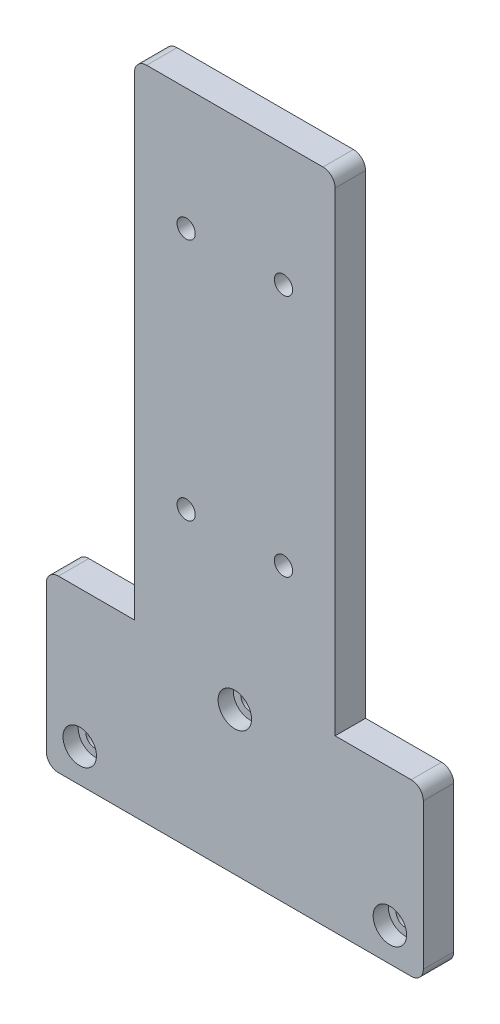
ISO-10303-21;
HEADER;
FILE_DESCRIPTION(('STEP AP214'),'2;1');
FILE_NAME('part.step','',(''),(''),'','','');
FILE_SCHEMA(('AUTOMOTIVE_DESIGN { 1 0 10303 214 1 1 1 1 }'));
ENDSEC;
DATA;
#1=APPLICATION_CONTEXT('core data for automotive mechanical design processes');
#2=APPLICATION_PROTOCOL_DEFINITION('international standard','automotive_design',2000,#1);
#3=PRODUCT_CONTEXT('',#1,'mechanical');
#4=PRODUCT('Part','Part','',(#3));
#5=PRODUCT_RELATED_PRODUCT_CATEGORY('part','',(#4));
#6=PRODUCT_DEFINITION_FORMATION('','',#4);
#7=PRODUCT_DEFINITION_CONTEXT('part definition',#1,'design');
#8=PRODUCT_DEFINITION('design','',#6,#7);
#9=PRODUCT_DEFINITION_SHAPE('','',#8);
#10=(LENGTH_UNIT() NAMED_UNIT(*) SI_UNIT(.MILLI.,.METRE.));
#11=(NAMED_UNIT(*) PLANE_ANGLE_UNIT() SI_UNIT($,.RADIAN.));
#12=(NAMED_UNIT(*) SI_UNIT($,.STERADIAN.) SOLID_ANGLE_UNIT());
#13=UNCERTAINTY_MEASURE_WITH_UNIT(LENGTH_MEASURE(1.E-05),#10,'distance_accuracy_value','');
#14=(GEOMETRIC_REPRESENTATION_CONTEXT(3) GLOBAL_UNCERTAINTY_ASSIGNED_CONTEXT((#13)) GLOBAL_UNIT_ASSIGNED_CONTEXT((#10,
#11,#12)) REPRESENTATION_CONTEXT('',''));
#15=CARTESIAN_POINT('',(0.,0.,0.));
#16=DIRECTION('',(0.,0.,1.));
#17=DIRECTION('',(1.,0.,0.));
#18=AXIS2_PLACEMENT_3D('',#15,#16,#17);
#19=CARTESIAN_POINT('',(31.,0.,5.));
#20=DIRECTION('',(0.,1.,0.));
#21=DIRECTION('',(-1.,0.,0.));
#22=AXIS2_PLACEMENT_3D('',#19,#20,#21);
#23=PLANE('',#22);
#24=DIRECTION('',(1.,0.,0.));
#25=VECTOR('',#24,1.);
#26=CARTESIAN_POINT('',(31.,0.,0.));
#27=LINE('',#26,#25);
#28=CARTESIAN_POINT('',(-29.,0.,0.));
#29=VERTEX_POINT('',#28);
#30=CARTESIAN_POINT('',(29.,0.,0.));
#31=VERTEX_POINT('',#30);
#32=EDGE_CURVE('E176',#29,#31,#27,.T.);
#33=ORIENTED_EDGE('',*,*,#32,.T.);
#34=DIRECTION('',(0.,0.,-1.));
#35=VECTOR('',#34,1.);
#36=CARTESIAN_POINT('',(29.,0.,5.));
#37=LINE('',#36,#35);
#38=CARTESIAN_POINT('',(29.,0.,5.));
#39=VERTEX_POINT('',#38);
#40=EDGE_CURVE('E239',#31,#39,#37,.F.);
#41=ORIENTED_EDGE('',*,*,#40,.T.);
#42=DIRECTION('',(1.,0.,0.));
#43=VECTOR('',#42,1.);
#44=CARTESIAN_POINT('',(31.,0.,5.));
#45=LINE('',#44,#43);
#46=CARTESIAN_POINT('',(-29.,0.,5.));
#47=VERTEX_POINT('',#46);
#48=EDGE_CURVE('E196',#47,#39,#45,.T.);
#49=ORIENTED_EDGE('',*,*,#48,.F.);
#50=DIRECTION('',(0.,0.,-1.));
#51=VECTOR('',#50,1.);
#52=CARTESIAN_POINT('',(-29.,0.,5.));
#53=LINE('',#52,#51);
#54=EDGE_CURVE('E236',#47,#29,#53,.T.);
#55=ORIENTED_EDGE('',*,*,#54,.T.);
#56=EDGE_LOOP('',(#33,#41,#49,#55));
#57=FACE_BOUND('',#56,.T.);
#58=ADVANCED_FACE('F36',(#57),#23,.F.);
#59=CARTESIAN_POINT('',(31.,28.,5.));
#60=DIRECTION('',(-1.,0.,0.));
#61=DIRECTION('',(0.,-1.,0.));
#62=AXIS2_PLACEMENT_3D('',#59,#60,#61);
#63=PLANE('',#62);
#64=DIRECTION('',(0.,1.,0.));
#65=VECTOR('',#64,1.);
#66=CARTESIAN_POINT('',(31.,28.,0.));
#67=LINE('',#66,#65);
#68=CARTESIAN_POINT('',(31.,2.00000000000001,0.));
#69=VERTEX_POINT('',#68);
#70=CARTESIAN_POINT('',(31.,26.,0.));
#71=VERTEX_POINT('',#70);
#72=EDGE_CURVE('E179',#69,#71,#67,.T.);
#73=ORIENTED_EDGE('',*,*,#72,.T.);
#74=DIRECTION('',(0.,0.,-1.));
#75=VECTOR('',#74,1.);
#76=CARTESIAN_POINT('',(31.,26.,5.));
#77=LINE('',#76,#75);
#78=CARTESIAN_POINT('',(31.,26.,5.));
#79=VERTEX_POINT('',#78);
#80=EDGE_CURVE('E234',#71,#79,#77,.F.);
#81=ORIENTED_EDGE('',*,*,#80,.T.);
#82=DIRECTION('',(0.,1.,0.));
#83=VECTOR('',#82,1.);
#84=CARTESIAN_POINT('',(31.,28.,5.));
#85=LINE('',#84,#83);
#86=CARTESIAN_POINT('',(31.,2.00000000000001,5.));
#87=VERTEX_POINT('',#86);
#88=EDGE_CURVE('E149',#87,#79,#85,.T.);
#89=ORIENTED_EDGE('',*,*,#88,.F.);
#90=DIRECTION('',(0.,0.,-1.));
#91=VECTOR('',#90,1.);
#92=CARTESIAN_POINT('',(31.,2.00000000000001,5.));
#93=LINE('',#92,#91);
#94=EDGE_CURVE('E231',#87,#69,#93,.T.);
#95=ORIENTED_EDGE('',*,*,#94,.T.);
#96=EDGE_LOOP('',(#73,#81,#89,#95));
#97=FACE_BOUND('',#96,.T.);
#98=ADVANCED_FACE('F393',(#97),#63,.F.);
#99=CARTESIAN_POINT('',(16.5,28.,5.));
#100=DIRECTION('',(0.,-1.,0.));
#101=DIRECTION('',(1.,0.,0.));
#102=AXIS2_PLACEMENT_3D('',#99,#100,#101);
#103=PLANE('',#102);
#104=DIRECTION('',(-1.,0.,0.));
#105=VECTOR('',#104,1.);
#106=CARTESIAN_POINT('',(16.5,28.,5.));
#107=LINE('',#106,#105);
#108=CARTESIAN_POINT('',(29.,28.,5.));
#109=VERTEX_POINT('',#108);
#110=CARTESIAN_POINT('',(16.5,28.,5.));
#111=VERTEX_POINT('',#110);
#112=EDGE_CURVE('E136',#109,#111,#107,.T.);
#113=ORIENTED_EDGE('',*,*,#112,.F.);
#114=DIRECTION('',(0.,0.,-1.));
#115=VECTOR('',#114,1.);
#116=CARTESIAN_POINT('',(29.,28.,5.));
#117=LINE('',#116,#115);
#118=CARTESIAN_POINT('',(29.,28.,0.));
#119=VERTEX_POINT('',#118);
#120=EDGE_CURVE('E229',#109,#119,#117,.T.);
#121=ORIENTED_EDGE('',*,*,#120,.T.);
#122=DIRECTION('',(-1.,0.,0.));
#123=VECTOR('',#122,1.);
#124=CARTESIAN_POINT('',(16.5,28.,0.));
#125=LINE('',#124,#123);
#126=CARTESIAN_POINT('',(16.5,28.,0.));
#127=VERTEX_POINT('',#126);
#128=EDGE_CURVE('E155',#119,#127,#125,.T.);
#129=ORIENTED_EDGE('',*,*,#128,.T.);
#130=DIRECTION('',(0.,0.,-1.));
#131=VECTOR('',#130,1.);
#132=CARTESIAN_POINT('',(16.5,28.,5.));
#133=LINE('',#132,#131);
#134=EDGE_CURVE('E152',#111,#127,#133,.T.);
#135=ORIENTED_EDGE('',*,*,#134,.F.);
#136=EDGE_LOOP('',(#113,#121,#129,#135));
#137=FACE_BOUND('',#136,.T.);
#138=ADVANCED_FACE('F153',(#137),#103,.F.);
#139=CARTESIAN_POINT('',(16.5,108.,5.));
#140=DIRECTION('',(-1.,0.,0.));
#141=DIRECTION('',(0.,-1.,0.));
#142=AXIS2_PLACEMENT_3D('',#139,#140,#141);
#143=PLANE('',#142);
#144=DIRECTION('',(0.,1.,0.));
#145=VECTOR('',#144,1.);
#146=CARTESIAN_POINT('',(16.5,108.,0.));
#147=LINE('',#146,#145);
#148=CARTESIAN_POINT('',(16.5,106.,0.));
#149=VERTEX_POINT('',#148);
#150=EDGE_CURVE('E184',#127,#149,#147,.T.);
#151=ORIENTED_EDGE('',*,*,#150,.T.);
#152=DIRECTION('',(0.,0.,-1.));
#153=VECTOR('',#152,1.);
#154=CARTESIAN_POINT('',(16.5,106.,5.));
#155=LINE('',#154,#153);
#156=CARTESIAN_POINT('',(16.5,106.,5.));
#157=VERTEX_POINT('',#156);
#158=EDGE_CURVE('E164',#149,#157,#155,.F.);
#159=ORIENTED_EDGE('',*,*,#158,.T.);
#160=DIRECTION('',(0.,1.,0.));
#161=VECTOR('',#160,1.);
#162=CARTESIAN_POINT('',(16.5,108.,5.));
#163=LINE('',#162,#161);
#164=EDGE_CURVE('E141',#111,#157,#163,.T.);
#165=ORIENTED_EDGE('',*,*,#164,.F.);
#166=ORIENTED_EDGE('',*,*,#134,.T.);
#167=EDGE_LOOP('',(#151,#159,#165,#166));
#168=FACE_BOUND('',#167,.T.);
#169=ADVANCED_FACE('F162',(#168),#143,.F.);
#170=CARTESIAN_POINT('',(-16.5,108.,5.));
#171=DIRECTION('',(0.,-1.,0.));
#172=DIRECTION('',(0.,0.,-1.));
#173=AXIS2_PLACEMENT_3D('',#170,#171,#172);
#174=PLANE('',#173);
#175=DIRECTION('',(-1.,0.,0.));
#176=VECTOR('',#175,1.);
#177=CARTESIAN_POINT('',(-16.5,108.,0.));
#178=LINE('',#177,#176);
#179=CARTESIAN_POINT('',(14.5,108.,0.));
#180=VERTEX_POINT('',#179);
#181=CARTESIAN_POINT('',(-14.5,108.,0.));
#182=VERTEX_POINT('',#181);
#183=EDGE_CURVE('E186',#180,#182,#178,.T.);
#184=ORIENTED_EDGE('',*,*,#183,.T.);
#185=DIRECTION('',(0.,0.,-1.));
#186=VECTOR('',#185,1.);
#187=CARTESIAN_POINT('',(-14.5,108.,5.));
#188=LINE('',#187,#186);
#189=CARTESIAN_POINT('',(-14.5,108.,5.));
#190=VERTEX_POINT('',#189);
#191=EDGE_CURVE('E216',#182,#190,#188,.F.);
#192=ORIENTED_EDGE('',*,*,#191,.T.);
#193=DIRECTION('',(-1.,0.,0.));
#194=VECTOR('',#193,1.);
#195=CARTESIAN_POINT('',(-16.5,108.,5.));
#196=LINE('',#195,#194);
#197=CARTESIAN_POINT('',(14.5,108.,5.));
#198=VERTEX_POINT('',#197);
#199=EDGE_CURVE('E165',#198,#190,#196,.T.);
#200=ORIENTED_EDGE('',*,*,#199,.F.);
#201=DIRECTION('',(0.,0.,-1.));
#202=VECTOR('',#201,1.);
#203=CARTESIAN_POINT('',(14.5,108.,5.));
#204=LINE('',#203,#202);
#205=EDGE_CURVE('E213',#198,#180,#204,.T.);
#206=ORIENTED_EDGE('',*,*,#205,.T.);
#207=EDGE_LOOP('',(#184,#192,#200,#206));
#208=FACE_BOUND('',#207,.T.);
#209=ADVANCED_FACE('F435',(#208),#174,.F.);
#210=CARTESIAN_POINT('',(-16.5,28.,5.));
#211=DIRECTION('',(1.,0.,0.));
#212=DIRECTION('',(0.,0.,-1.));
#213=AXIS2_PLACEMENT_3D('',#210,#211,#212);
#214=PLANE('',#213);
#215=DIRECTION('',(0.,-1.,0.));
#216=VECTOR('',#215,1.);
#217=CARTESIAN_POINT('',(-16.5,28.,5.));
#218=LINE('',#217,#216);
#219=CARTESIAN_POINT('',(-16.5,106.,5.));
#220=VERTEX_POINT('',#219);
#221=CARTESIAN_POINT('',(-16.5,28.,5.));
#222=VERTEX_POINT('',#221);
#223=EDGE_CURVE('E167',#220,#222,#218,.T.);
#224=ORIENTED_EDGE('',*,*,#223,.F.);
#225=DIRECTION('',(0.,0.,-1.));
#226=VECTOR('',#225,1.);
#227=CARTESIAN_POINT('',(-16.5,106.,5.));
#228=LINE('',#227,#226);
#229=CARTESIAN_POINT('',(-16.5,106.,0.));
#230=VERTEX_POINT('',#229);
#231=EDGE_CURVE('E159',#220,#230,#228,.T.);
#232=ORIENTED_EDGE('',*,*,#231,.T.);
#233=DIRECTION('',(0.,-1.,0.));
#234=VECTOR('',#233,1.);
#235=CARTESIAN_POINT('',(-16.5,28.,0.));
#236=LINE('',#235,#234);
#237=CARTESIAN_POINT('',(-16.5,28.,0.));
#238=VERTEX_POINT('',#237);
#239=EDGE_CURVE('E189',#230,#238,#236,.T.);
#240=ORIENTED_EDGE('',*,*,#239,.T.);
#241=DIRECTION('',(0.,0.,-1.));
#242=VECTOR('',#241,1.);
#243=CARTESIAN_POINT('',(-16.5,28.,5.));
#244=LINE('',#243,#242);
#245=EDGE_CURVE('E160',#222,#238,#244,.T.);
#246=ORIENTED_EDGE('',*,*,#245,.F.);
#247=EDGE_LOOP('',(#224,#232,#240,#246));
#248=FACE_BOUND('',#247,.T.);
#249=ADVANCED_FACE('F431',(#248),#214,.F.);
#250=CARTESIAN_POINT('',(-31.,28.,5.));
#251=DIRECTION('',(0.,-1.,0.));
#252=DIRECTION('',(1.,0.,0.));
#253=AXIS2_PLACEMENT_3D('',#250,#251,#252);
#254=PLANE('',#253);
#255=DIRECTION('',(-1.,0.,0.));
#256=VECTOR('',#255,1.);
#257=CARTESIAN_POINT('',(-31.,28.,0.));
#258=LINE('',#257,#256);
#259=CARTESIAN_POINT('',(-29.,28.,0.));
#260=VERTEX_POINT('',#259);
#261=EDGE_CURVE('E191',#238,#260,#258,.T.);
#262=ORIENTED_EDGE('',*,*,#261,.T.);
#263=DIRECTION('',(0.,0.,-1.));
#264=VECTOR('',#263,1.);
#265=CARTESIAN_POINT('',(-29.,28.,5.));
#266=LINE('',#265,#264);
#267=CARTESIAN_POINT('',(-29.,28.,5.));
#268=VERTEX_POINT('',#267);
#269=EDGE_CURVE('E11',#260,#268,#266,.F.);
#270=ORIENTED_EDGE('',*,*,#269,.T.);
#271=DIRECTION('',(-1.,0.,0.));
#272=VECTOR('',#271,1.);
#273=CARTESIAN_POINT('',(-31.,28.,5.));
#274=LINE('',#273,#272);
#275=EDGE_CURVE('E172',#222,#268,#274,.T.);
#276=ORIENTED_EDGE('',*,*,#275,.F.);
#277=ORIENTED_EDGE('',*,*,#245,.T.);
#278=EDGE_LOOP('',(#262,#270,#276,#277));
#279=FACE_BOUND('',#278,.T.);
#280=ADVANCED_FACE('F389',(#279),#254,.F.);
#281=CARTESIAN_POINT('',(-31.,0.,5.));
#282=DIRECTION('',(1.,0.,0.));
#283=DIRECTION('',(0.,0.,-1.));
#284=AXIS2_PLACEMENT_3D('',#281,#282,#283);
#285=PLANE('',#284);
#286=DIRECTION('',(0.,-1.,0.));
#287=VECTOR('',#286,1.);
#288=CARTESIAN_POINT('',(-31.,0.,0.));
#289=LINE('',#288,#287);
#290=CARTESIAN_POINT('',(-31.,26.,0.));
#291=VERTEX_POINT('',#290);
#292=CARTESIAN_POINT('',(-31.,2.,0.));
#293=VERTEX_POINT('',#292);
#294=EDGE_CURVE('E194',#291,#293,#289,.T.);
#295=ORIENTED_EDGE('',*,*,#294,.T.);
#296=DIRECTION('',(0.,0.,-1.));
#297=VECTOR('',#296,1.);
#298=CARTESIAN_POINT('',(-31.,2.,5.));
#299=LINE('',#298,#297);
#300=CARTESIAN_POINT('',(-31.,2.,5.));
#301=VERTEX_POINT('',#300);
#302=EDGE_CURVE('E44',#293,#301,#299,.F.);
#303=ORIENTED_EDGE('',*,*,#302,.T.);
#304=DIRECTION('',(0.,-1.,0.));
#305=VECTOR('',#304,1.);
#306=CARTESIAN_POINT('',(-31.,0.,5.));
#307=LINE('',#306,#305);
#308=CARTESIAN_POINT('',(-31.,26.,5.));
#309=VERTEX_POINT('',#308);
#310=EDGE_CURVE('E174',#309,#301,#307,.T.);
#311=ORIENTED_EDGE('',*,*,#310,.F.);
#312=DIRECTION('',(0.,0.,-1.));
#313=VECTOR('',#312,1.);
#314=CARTESIAN_POINT('',(-31.,26.,5.));
#315=LINE('',#314,#313);
#316=EDGE_CURVE('E241',#309,#291,#315,.T.);
#317=ORIENTED_EDGE('',*,*,#316,.T.);
#318=EDGE_LOOP('',(#295,#303,#311,#317));
#319=FACE_BOUND('',#318,.T.);
#320=ADVANCED_FACE('F245',(#319),#285,.F.);
#321=CARTESIAN_POINT('',(0.,0.,5.));
#322=DIRECTION('',(0.,0.,-1.));
#323=DIRECTION('',(-1.,0.,0.));
#324=AXIS2_PLACEMENT_3D('',#321,#322,#323);
#325=PLANE('',#324);
#326=CARTESIAN_POINT('',(7.99999999999999,48.,5.));
#327=DIRECTION('',(0.,0.,-1.));
#328=DIRECTION('',(-1.,0.,0.));
#329=AXIS2_PLACEMENT_3D('',#326,#327,#328);
#330=CIRCLE('',#329,1.50000000000001);
#331=CARTESIAN_POINT('',(6.49999999999998,48.,5.));
#332=VERTEX_POINT('',#331);
#333=EDGE_CURVE('E334',#332,#332,#330,.T.);
#334=ORIENTED_EDGE('',*,*,#333,.T.);
#335=EDGE_LOOP('',(#334));
#336=FACE_BOUND('',#335,.T.);
#337=CARTESIAN_POINT('',(-8.,48.,5.));
#338=DIRECTION('',(0.,0.,-1.));
#339=DIRECTION('',(-1.,0.,0.));
#340=AXIS2_PLACEMENT_3D('',#337,#338,#339);
#341=CIRCLE('',#340,1.50000000000001);
#342=CARTESIAN_POINT('',(-9.50000000000001,48.,5.));
#343=VERTEX_POINT('',#342);
#344=EDGE_CURVE('E322',#343,#343,#341,.T.);
#345=ORIENTED_EDGE('',*,*,#344,.T.);
#346=EDGE_LOOP('',(#345));
#347=FACE_BOUND('',#346,.T.);
#348=CARTESIAN_POINT('',(-8.,88.,5.));
#349=DIRECTION('',(0.,0.,-1.));
#350=DIRECTION('',(-1.,0.,0.));
#351=AXIS2_PLACEMENT_3D('',#348,#349,#350);
#352=CIRCLE('',#351,1.50000000000001);
#353=CARTESIAN_POINT('',(-9.50000000000001,88.,5.));
#354=VERTEX_POINT('',#353);
#355=EDGE_CURVE('E310',#354,#354,#352,.T.);
#356=ORIENTED_EDGE('',*,*,#355,.T.);
#357=EDGE_LOOP('',(#356));
#358=FACE_BOUND('',#357,.T.);
#359=CARTESIAN_POINT('',(7.99999999999999,88.,5.));
#360=DIRECTION('',(0.,0.,-1.));
#361=DIRECTION('',(-1.,0.,0.));
#362=AXIS2_PLACEMENT_3D('',#359,#360,#361);
#363=CIRCLE('',#362,1.50000000000001);
#364=CARTESIAN_POINT('',(6.49999999999998,88.,5.));
#365=VERTEX_POINT('',#364);
#366=EDGE_CURVE('E298',#365,#365,#363,.T.);
#367=ORIENTED_EDGE('',*,*,#366,.T.);
#368=EDGE_LOOP('',(#367));
#369=FACE_BOUND('',#368,.T.);
#370=CARTESIAN_POINT('',(-25.5,5.5,5.));
#371=DIRECTION('',(0.,0.,1.));
#372=DIRECTION('',(1.,0.,0.));
#373=AXIS2_PLACEMENT_3D('',#370,#371,#372);
#374=CIRCLE('',#373,2.75000000000001);
#375=CARTESIAN_POINT('',(-22.75,5.5,5.));
#376=VERTEX_POINT('',#375);
#377=EDGE_CURVE('E295',#376,#376,#374,.T.);
#378=ORIENTED_EDGE('',*,*,#377,.F.);
#379=EDGE_LOOP('',(#378));
#380=FACE_BOUND('',#379,.T.);
#381=CARTESIAN_POINT('',(25.5,5.5,5.));
#382=DIRECTION('',(0.,0.,1.));
#383=DIRECTION('',(1.,0.,0.));
#384=AXIS2_PLACEMENT_3D('',#381,#382,#383);
#385=CIRCLE('',#384,2.75000000000001);
#386=CARTESIAN_POINT('',(28.25,5.5,5.));
#387=VERTEX_POINT('',#386);
#388=EDGE_CURVE('E283',#387,#387,#385,.T.);
#389=ORIENTED_EDGE('',*,*,#388,.F.);
#390=EDGE_LOOP('',(#389));
#391=FACE_BOUND('',#390,.T.);
#392=CARTESIAN_POINT('',(0.,23.5,5.));
#393=DIRECTION('',(0.,0.,1.));
#394=DIRECTION('',(1.,0.,0.));
#395=AXIS2_PLACEMENT_3D('',#392,#393,#394);
#396=CIRCLE('',#395,2.75000000000001);
#397=CARTESIAN_POINT('',(2.75000000000001,23.5,5.));
#398=VERTEX_POINT('',#397);
#399=EDGE_CURVE('E271',#398,#398,#396,.T.);
#400=ORIENTED_EDGE('',*,*,#399,.F.);
#401=EDGE_LOOP('',(#400));
#402=FACE_BOUND('',#401,.T.);
#403=ORIENTED_EDGE('',*,*,#199,.T.);
#404=CARTESIAN_POINT('',(-14.5,106.,5.));
#405=DIRECTION('',(0.,0.,-1.));
#406=DIRECTION('',(-1.,0.,0.));
#407=AXIS2_PLACEMENT_3D('',#404,#405,#406);
#408=CIRCLE('',#407,2.);
#409=EDGE_CURVE('E226',#190,#220,#408,.F.);
#410=ORIENTED_EDGE('',*,*,#409,.T.);
#411=ORIENTED_EDGE('',*,*,#223,.T.);
#412=ORIENTED_EDGE('',*,*,#275,.T.);
#413=CARTESIAN_POINT('',(-29.,26.,5.));
#414=DIRECTION('',(0.,0.,-1.));
#415=DIRECTION('',(-1.,0.,0.));
#416=AXIS2_PLACEMENT_3D('',#413,#414,#415);
#417=CIRCLE('',#416,2.);
#418=EDGE_CURVE('E57',#268,#309,#417,.F.);
#419=ORIENTED_EDGE('',*,*,#418,.T.);
#420=ORIENTED_EDGE('',*,*,#310,.T.);
#421=CARTESIAN_POINT('',(-29.,2.,5.));
#422=DIRECTION('',(0.,0.,-1.));
#423=DIRECTION('',(-1.,0.,0.));
#424=AXIS2_PLACEMENT_3D('',#421,#422,#423);
#425=CIRCLE('',#424,2.);
#426=EDGE_CURVE('E219',#301,#47,#425,.F.);
#427=ORIENTED_EDGE('',*,*,#426,.T.);
#428=ORIENTED_EDGE('',*,*,#48,.T.);
#429=CARTESIAN_POINT('',(29.,2.00000000000001,5.));
#430=DIRECTION('',(0.,0.,-1.));
#431=DIRECTION('',(-1.,0.,0.));
#432=AXIS2_PLACEMENT_3D('',#429,#430,#431);
#433=CIRCLE('',#432,2.);
#434=EDGE_CURVE('E221',#39,#87,#433,.F.);
#435=ORIENTED_EDGE('',*,*,#434,.T.);
#436=ORIENTED_EDGE('',*,*,#88,.T.);
#437=CARTESIAN_POINT('',(29.,26.,5.));
#438=DIRECTION('',(0.,0.,-1.));
#439=DIRECTION('',(-1.,0.,0.));
#440=AXIS2_PLACEMENT_3D('',#437,#438,#439);
#441=CIRCLE('',#440,2.);
#442=EDGE_CURVE('E145',#79,#109,#441,.F.);
#443=ORIENTED_EDGE('',*,*,#442,.T.);
#444=ORIENTED_EDGE('',*,*,#112,.T.);
#445=ORIENTED_EDGE('',*,*,#164,.T.);
#446=CARTESIAN_POINT('',(14.5,106.,5.));
#447=DIRECTION('',(0.,0.,-1.));
#448=DIRECTION('',(-1.,0.,0.));
#449=AXIS2_PLACEMENT_3D('',#446,#447,#448);
#450=CIRCLE('',#449,2.);
#451=EDGE_CURVE('E224',#157,#198,#450,.F.);
#452=ORIENTED_EDGE('',*,*,#451,.T.);
#453=EDGE_LOOP('',(#403,#410,#411,#412,#419,#420,#427,#428,#435,#436,#443,#444,#445,#452));
#454=FACE_BOUND('',#453,.T.);
#455=ADVANCED_FACE('F139',(#336,#347,#358,#369,#380,#391,#402,#454),#325,.F.);
#456=CARTESIAN_POINT('',(0.,0.,0.));
#457=DIRECTION('',(0.,0.,-1.));
#458=DIRECTION('',(-1.,0.,0.));
#459=AXIS2_PLACEMENT_3D('',#456,#457,#458);
#460=PLANE('',#459);
#461=CARTESIAN_POINT('',(7.99999999999999,48.,0.));
#462=DIRECTION('',(0.,0.,-1.));
#463=DIRECTION('',(-1.,0.,0.));
#464=AXIS2_PLACEMENT_3D('',#461,#462,#463);
#465=CIRCLE('',#464,2.75000000000001);
#466=CARTESIAN_POINT('',(5.24999999999998,48.,0.));
#467=VERTEX_POINT('',#466);
#468=EDGE_CURVE('E343',#467,#467,#465,.T.);
#469=ORIENTED_EDGE('',*,*,#468,.F.);
#470=EDGE_LOOP('',(#469));
#471=FACE_BOUND('',#470,.T.);
#472=CARTESIAN_POINT('',(-8.,48.,0.));
#473=DIRECTION('',(0.,0.,-1.));
#474=DIRECTION('',(-1.,0.,0.));
#475=AXIS2_PLACEMENT_3D('',#472,#473,#474);
#476=CIRCLE('',#475,2.75000000000001);
#477=CARTESIAN_POINT('',(-10.75,48.,0.));
#478=VERTEX_POINT('',#477);
#479=EDGE_CURVE('E331',#478,#478,#476,.T.);
#480=ORIENTED_EDGE('',*,*,#479,.F.);
#481=EDGE_LOOP('',(#480));
#482=FACE_BOUND('',#481,.T.);
#483=CARTESIAN_POINT('',(-8.,88.,0.));
#484=DIRECTION('',(0.,0.,-1.));
#485=DIRECTION('',(-1.,0.,0.));
#486=AXIS2_PLACEMENT_3D('',#483,#484,#485);
#487=CIRCLE('',#486,2.75000000000001);
#488=CARTESIAN_POINT('',(-10.75,88.,0.));
#489=VERTEX_POINT('',#488);
#490=EDGE_CURVE('E319',#489,#489,#487,.T.);
#491=ORIENTED_EDGE('',*,*,#490,.F.);
#492=EDGE_LOOP('',(#491));
#493=FACE_BOUND('',#492,.T.);
#494=CARTESIAN_POINT('',(7.99999999999999,88.,0.));
#495=DIRECTION('',(0.,0.,-1.));
#496=DIRECTION('',(-1.,0.,0.));
#497=AXIS2_PLACEMENT_3D('',#494,#495,#496);
#498=CIRCLE('',#497,2.75000000000001);
#499=CARTESIAN_POINT('',(5.24999999999998,88.,0.));
#500=VERTEX_POINT('',#499);
#501=EDGE_CURVE('E307',#500,#500,#498,.T.);
#502=ORIENTED_EDGE('',*,*,#501,.F.);
#503=EDGE_LOOP('',(#502));
#504=FACE_BOUND('',#503,.T.);
#505=CARTESIAN_POINT('',(-25.5,5.5,0.));
#506=DIRECTION('',(0.,0.,1.));
#507=DIRECTION('',(1.,0.,0.));
#508=AXIS2_PLACEMENT_3D('',#505,#506,#507);
#509=CIRCLE('',#508,1.50000000000001);
#510=CARTESIAN_POINT('',(-24.,5.5,0.));
#511=VERTEX_POINT('',#510);
#512=EDGE_CURVE('E286',#511,#511,#509,.T.);
#513=ORIENTED_EDGE('',*,*,#512,.T.);
#514=EDGE_LOOP('',(#513));
#515=FACE_BOUND('',#514,.T.);
#516=CARTESIAN_POINT('',(25.5,5.5,0.));
#517=DIRECTION('',(0.,0.,1.));
#518=DIRECTION('',(1.,0.,0.));
#519=AXIS2_PLACEMENT_3D('',#516,#517,#518);
#520=CIRCLE('',#519,1.50000000000001);
#521=CARTESIAN_POINT('',(27.,5.5,0.));
#522=VERTEX_POINT('',#521);
#523=EDGE_CURVE('E274',#522,#522,#520,.T.);
#524=ORIENTED_EDGE('',*,*,#523,.T.);
#525=EDGE_LOOP('',(#524));
#526=FACE_BOUND('',#525,.T.);
#527=CARTESIAN_POINT('',(0.,23.5,0.));
#528=DIRECTION('',(0.,0.,1.));
#529=DIRECTION('',(1.,0.,0.));
#530=AXIS2_PLACEMENT_3D('',#527,#528,#529);
#531=CIRCLE('',#530,1.50000000000001);
#532=CARTESIAN_POINT('',(1.50000000000001,23.5,0.));
#533=VERTEX_POINT('',#532);
#534=EDGE_CURVE('E180',#533,#533,#531,.T.);
#535=ORIENTED_EDGE('',*,*,#534,.T.);
#536=EDGE_LOOP('',(#535));
#537=FACE_BOUND('',#536,.T.);
#538=ORIENTED_EDGE('',*,*,#239,.F.);
#539=CARTESIAN_POINT('',(-14.5,106.,0.));
#540=DIRECTION('',(0.,0.,-1.));
#541=DIRECTION('',(-1.,0.,0.));
#542=AXIS2_PLACEMENT_3D('',#539,#540,#541);
#543=CIRCLE('',#542,2.);
#544=EDGE_CURVE('E211',#230,#182,#543,.T.);
#545=ORIENTED_EDGE('',*,*,#544,.T.);
#546=ORIENTED_EDGE('',*,*,#183,.F.);
#547=CARTESIAN_POINT('',(14.5,106.,0.));
#548=DIRECTION('',(0.,0.,-1.));
#549=DIRECTION('',(-1.,0.,0.));
#550=AXIS2_PLACEMENT_3D('',#547,#548,#549);
#551=CIRCLE('',#550,2.);
#552=EDGE_CURVE('E209',#180,#149,#551,.T.);
#553=ORIENTED_EDGE('',*,*,#552,.T.);
#554=ORIENTED_EDGE('',*,*,#150,.F.);
#555=ORIENTED_EDGE('',*,*,#128,.F.);
#556=CARTESIAN_POINT('',(29.,26.,0.));
#557=DIRECTION('',(0.,0.,-1.));
#558=DIRECTION('',(-1.,0.,0.));
#559=AXIS2_PLACEMENT_3D('',#556,#557,#558);
#560=CIRCLE('',#559,2.);
#561=EDGE_CURVE('E207',#119,#71,#560,.T.);
#562=ORIENTED_EDGE('',*,*,#561,.T.);
#563=ORIENTED_EDGE('',*,*,#72,.F.);
#564=CARTESIAN_POINT('',(29.,2.00000000000001,0.));
#565=DIRECTION('',(0.,0.,-1.));
#566=DIRECTION('',(-1.,0.,0.));
#567=AXIS2_PLACEMENT_3D('',#564,#565,#566);
#568=CIRCLE('',#567,2.);
#569=EDGE_CURVE('E205',#69,#31,#568,.T.);
#570=ORIENTED_EDGE('',*,*,#569,.T.);
#571=ORIENTED_EDGE('',*,*,#32,.F.);
#572=CARTESIAN_POINT('',(-29.,2.,0.));
#573=DIRECTION('',(0.,0.,-1.));
#574=DIRECTION('',(-1.,0.,0.));
#575=AXIS2_PLACEMENT_3D('',#572,#573,#574);
#576=CIRCLE('',#575,2.);
#577=EDGE_CURVE('E203',#29,#293,#576,.T.);
#578=ORIENTED_EDGE('',*,*,#577,.T.);
#579=ORIENTED_EDGE('',*,*,#294,.F.);
#580=CARTESIAN_POINT('',(-29.,26.,0.));
#581=DIRECTION('',(0.,0.,-1.));
#582=DIRECTION('',(-1.,0.,0.));
#583=AXIS2_PLACEMENT_3D('',#580,#581,#582);
#584=CIRCLE('',#583,2.);
#585=EDGE_CURVE('E201',#291,#260,#584,.T.);
#586=ORIENTED_EDGE('',*,*,#585,.T.);
#587=ORIENTED_EDGE('',*,*,#261,.F.);
#588=EDGE_LOOP('',(#538,#545,#546,#553,#554,#555,#562,#563,#570,#571,#578,#579,#586,#587));
#589=FACE_BOUND('',#588,.T.);
#590=ADVANCED_FACE('F249',(#471,#482,#493,#504,#515,#526,#537,#589),#460,.T.);
#591=CARTESIAN_POINT('',(0.,23.5,5.));
#592=DIRECTION('',(0.,0.,1.));
#593=DIRECTION('',(1.,0.,0.));
#594=AXIS2_PLACEMENT_3D('',#591,#592,#593);
#595=CYLINDRICAL_SURFACE('',#594,1.50000000000001);
#596=ORIENTED_EDGE('',*,*,#534,.F.);
#597=EDGE_LOOP('',(#596));
#598=FACE_BOUND('',#597,.T.);
#599=CARTESIAN_POINT('',(0.,23.5,2.5));
#600=DIRECTION('',(0.,0.,1.));
#601=DIRECTION('',(1.,0.,0.));
#602=AXIS2_PLACEMENT_3D('',#599,#600,#601);
#603=CIRCLE('',#602,1.50000000000001);
#604=CARTESIAN_POINT('',(1.50000000000001,23.5,2.5));
#605=VERTEX_POINT('',#604);
#606=EDGE_CURVE('E265',#605,#605,#603,.T.);
#607=ORIENTED_EDGE('',*,*,#606,.T.);
#608=EDGE_LOOP('',(#607));
#609=FACE_BOUND('',#608,.T.);
#610=ADVANCED_FACE('F351',(#598,#609),#595,.F.);
#611=CARTESIAN_POINT('',(1.50000000000001,23.5,2.5));
#612=DIRECTION('',(0.,0.,-1.));
#613=DIRECTION('',(-1.,0.,0.));
#614=AXIS2_PLACEMENT_3D('',#611,#612,#613);
#615=PLANE('',#614);
#616=ORIENTED_EDGE('',*,*,#606,.F.);
#617=EDGE_LOOP('',(#616));
#618=FACE_BOUND('',#617,.T.);
#619=CARTESIAN_POINT('',(0.,23.5,2.5));
#620=DIRECTION('',(0.,0.,1.));
#621=DIRECTION('',(1.,0.,0.));
#622=AXIS2_PLACEMENT_3D('',#619,#620,#621);
#623=CIRCLE('',#622,2.75000000000001);
#624=CARTESIAN_POINT('',(2.75000000000001,23.5,2.5));
#625=VERTEX_POINT('',#624);
#626=EDGE_CURVE('E268',#625,#625,#623,.T.);
#627=ORIENTED_EDGE('',*,*,#626,.T.);
#628=EDGE_LOOP('',(#627));
#629=FACE_BOUND('',#628,.T.);
#630=ADVANCED_FACE('F367',(#618,#629),#615,.F.);
#631=CARTESIAN_POINT('',(0.,23.5,5.));
#632=DIRECTION('',(0.,0.,1.));
#633=DIRECTION('',(1.,0.,0.));
#634=AXIS2_PLACEMENT_3D('',#631,#632,#633);
#635=CYLINDRICAL_SURFACE('',#634,2.75000000000001);
#636=ORIENTED_EDGE('',*,*,#626,.F.);
#637=EDGE_LOOP('',(#636));
#638=FACE_BOUND('',#637,.T.);
#639=ORIENTED_EDGE('',*,*,#399,.T.);
#640=EDGE_LOOP('',(#639));
#641=FACE_BOUND('',#640,.T.);
#642=ADVANCED_FACE('F373',(#638,#641),#635,.F.);
#643=CARTESIAN_POINT('',(25.5,5.5,5.));
#644=DIRECTION('',(0.,0.,1.));
#645=DIRECTION('',(1.,0.,0.));
#646=AXIS2_PLACEMENT_3D('',#643,#644,#645);
#647=CYLINDRICAL_SURFACE('',#646,1.50000000000001);
#648=ORIENTED_EDGE('',*,*,#523,.F.);
#649=EDGE_LOOP('',(#648));
#650=FACE_BOUND('',#649,.T.);
#651=CARTESIAN_POINT('',(25.5,5.5,2.5));
#652=DIRECTION('',(0.,0.,1.));
#653=DIRECTION('',(1.,0.,0.));
#654=AXIS2_PLACEMENT_3D('',#651,#652,#653);
#655=CIRCLE('',#654,1.50000000000001);
#656=CARTESIAN_POINT('',(27.,5.5,2.5));
#657=VERTEX_POINT('',#656);
#658=EDGE_CURVE('E277',#657,#657,#655,.T.);
#659=ORIENTED_EDGE('',*,*,#658,.T.);
#660=EDGE_LOOP('',(#659));
#661=FACE_BOUND('',#660,.T.);
#662=ADVANCED_FACE('F379',(#650,#661),#647,.F.);
#663=CARTESIAN_POINT('',(27.,5.5,2.5));
#664=DIRECTION('',(0.,0.,-1.));
#665=DIRECTION('',(-1.,0.,0.));
#666=AXIS2_PLACEMENT_3D('',#663,#664,#665);
#667=PLANE('',#666);
#668=ORIENTED_EDGE('',*,*,#658,.F.);
#669=EDGE_LOOP('',(#668));
#670=FACE_BOUND('',#669,.T.);
#671=CARTESIAN_POINT('',(25.5,5.5,2.5));
#672=DIRECTION('',(0.,0.,1.));
#673=DIRECTION('',(1.,0.,0.));
#674=AXIS2_PLACEMENT_3D('',#671,#672,#673);
#675=CIRCLE('',#674,2.75000000000001);
#676=CARTESIAN_POINT('',(28.25,5.5,2.5));
#677=VERTEX_POINT('',#676);
#678=EDGE_CURVE('E280',#677,#677,#675,.T.);
#679=ORIENTED_EDGE('',*,*,#678,.T.);
#680=EDGE_LOOP('',(#679));
#681=FACE_BOUND('',#680,.T.);
#682=ADVANCED_FACE('F654',(#670,#681),#667,.F.);
#683=CARTESIAN_POINT('',(25.5,5.5,5.));
#684=DIRECTION('',(0.,0.,1.));
#685=DIRECTION('',(1.,0.,0.));
#686=AXIS2_PLACEMENT_3D('',#683,#684,#685);
#687=CYLINDRICAL_SURFACE('',#686,2.75000000000001);
#688=ORIENTED_EDGE('',*,*,#678,.F.);
#689=EDGE_LOOP('',(#688));
#690=FACE_BOUND('',#689,.T.);
#691=ORIENTED_EDGE('',*,*,#388,.T.);
#692=EDGE_LOOP('',(#691));
#693=FACE_BOUND('',#692,.T.);
#694=ADVANCED_FACE('F646',(#690,#693),#687,.F.);
#695=CARTESIAN_POINT('',(-25.5,5.5,5.));
#696=DIRECTION('',(0.,0.,1.));
#697=DIRECTION('',(1.,0.,0.));
#698=AXIS2_PLACEMENT_3D('',#695,#696,#697);
#699=CYLINDRICAL_SURFACE('',#698,1.50000000000001);
#700=ORIENTED_EDGE('',*,*,#512,.F.);
#701=EDGE_LOOP('',(#700));
#702=FACE_BOUND('',#701,.T.);
#703=CARTESIAN_POINT('',(-25.5,5.5,2.5));
#704=DIRECTION('',(0.,0.,1.));
#705=DIRECTION('',(1.,0.,0.));
#706=AXIS2_PLACEMENT_3D('',#703,#704,#705);
#707=CIRCLE('',#706,1.50000000000001);
#708=CARTESIAN_POINT('',(-24.,5.5,2.5));
#709=VERTEX_POINT('',#708);
#710=EDGE_CURVE('E289',#709,#709,#707,.T.);
#711=ORIENTED_EDGE('',*,*,#710,.T.);
#712=EDGE_LOOP('',(#711));
#713=FACE_BOUND('',#712,.T.);
#714=ADVANCED_FACE('F638',(#702,#713),#699,.F.);
#715=CARTESIAN_POINT('',(-24.,5.5,2.5));
#716=DIRECTION('',(0.,0.,-1.));
#717=DIRECTION('',(-1.,0.,0.));
#718=AXIS2_PLACEMENT_3D('',#715,#716,#717);
#719=PLANE('',#718);
#720=ORIENTED_EDGE('',*,*,#710,.F.);
#721=EDGE_LOOP('',(#720));
#722=FACE_BOUND('',#721,.T.);
#723=CARTESIAN_POINT('',(-25.5,5.5,2.5));
#724=DIRECTION('',(0.,0.,1.));
#725=DIRECTION('',(1.,0.,0.));
#726=AXIS2_PLACEMENT_3D('',#723,#724,#725);
#727=CIRCLE('',#726,2.75000000000001);
#728=CARTESIAN_POINT('',(-22.75,5.5,2.5));
#729=VERTEX_POINT('',#728);
#730=EDGE_CURVE('E292',#729,#729,#727,.T.);
#731=ORIENTED_EDGE('',*,*,#730,.T.);
#732=EDGE_LOOP('',(#731));
#733=FACE_BOUND('',#732,.T.);
#734=ADVANCED_FACE('F630',(#722,#733),#719,.F.);
#735=CARTESIAN_POINT('',(-25.5,5.5,5.));
#736=DIRECTION('',(0.,0.,1.));
#737=DIRECTION('',(1.,0.,0.));
#738=AXIS2_PLACEMENT_3D('',#735,#736,#737);
#739=CYLINDRICAL_SURFACE('',#738,2.75000000000001);
#740=ORIENTED_EDGE('',*,*,#730,.F.);
#741=EDGE_LOOP('',(#740));
#742=FACE_BOUND('',#741,.T.);
#743=ORIENTED_EDGE('',*,*,#377,.T.);
#744=EDGE_LOOP('',(#743));
#745=FACE_BOUND('',#744,.T.);
#746=ADVANCED_FACE('F622',(#742,#745),#739,.F.);
#747=CARTESIAN_POINT('',(7.99999999999999,88.,0.));
#748=DIRECTION('',(0.,0.,-1.));
#749=DIRECTION('',(-1.,0.,0.));
#750=AXIS2_PLACEMENT_3D('',#747,#748,#749);
#751=CYLINDRICAL_SURFACE('',#750,1.50000000000001);
#752=ORIENTED_EDGE('',*,*,#366,.F.);
#753=EDGE_LOOP('',(#752));
#754=FACE_BOUND('',#753,.T.);
#755=CARTESIAN_POINT('',(7.99999999999999,88.,2.5));
#756=DIRECTION('',(0.,0.,-1.));
#757=DIRECTION('',(-1.,0.,0.));
#758=AXIS2_PLACEMENT_3D('',#755,#756,#757);
#759=CIRCLE('',#758,1.50000000000001);
#760=CARTESIAN_POINT('',(6.49999999999998,88.,2.5));
#761=VERTEX_POINT('',#760);
#762=EDGE_CURVE('E301',#761,#761,#759,.T.);
#763=ORIENTED_EDGE('',*,*,#762,.T.);
#764=EDGE_LOOP('',(#763));
#765=FACE_BOUND('',#764,.T.);
#766=ADVANCED_FACE('F614',(#754,#765),#751,.F.);
#767=CARTESIAN_POINT('',(9.50000000000001,88.,2.5));
#768=DIRECTION('',(0.,0.,1.));
#769=DIRECTION('',(1.,0.,0.));
#770=AXIS2_PLACEMENT_3D('',#767,#768,#769);
#771=PLANE('',#770);
#772=ORIENTED_EDGE('',*,*,#762,.F.);
#773=EDGE_LOOP('',(#772));
#774=FACE_BOUND('',#773,.T.);
#775=CARTESIAN_POINT('',(7.99999999999999,88.,2.5));
#776=DIRECTION('',(0.,0.,-1.));
#777=DIRECTION('',(-1.,0.,0.));
#778=AXIS2_PLACEMENT_3D('',#775,#776,#777);
#779=CIRCLE('',#778,2.75000000000001);
#780=CARTESIAN_POINT('',(5.24999999999998,88.,2.5));
#781=VERTEX_POINT('',#780);
#782=EDGE_CURVE('E304',#781,#781,#779,.T.);
#783=ORIENTED_EDGE('',*,*,#782,.T.);
#784=EDGE_LOOP('',(#783));
#785=FACE_BOUND('',#784,.T.);
#786=ADVANCED_FACE('F606',(#774,#785),#771,.F.);
#787=CARTESIAN_POINT('',(7.99999999999999,88.,0.));
#788=DIRECTION('',(0.,0.,-1.));
#789=DIRECTION('',(-1.,0.,0.));
#790=AXIS2_PLACEMENT_3D('',#787,#788,#789);
#791=CYLINDRICAL_SURFACE('',#790,2.75000000000001);
#792=ORIENTED_EDGE('',*,*,#782,.F.);
#793=EDGE_LOOP('',(#792));
#794=FACE_BOUND('',#793,.T.);
#795=ORIENTED_EDGE('',*,*,#501,.T.);
#796=EDGE_LOOP('',(#795));
#797=FACE_BOUND('',#796,.T.);
#798=ADVANCED_FACE('F598',(#794,#797),#791,.F.);
#799=CARTESIAN_POINT('',(-8.,88.,0.));
#800=DIRECTION('',(0.,0.,-1.));
#801=DIRECTION('',(-1.,0.,0.));
#802=AXIS2_PLACEMENT_3D('',#799,#800,#801);
#803=CYLINDRICAL_SURFACE('',#802,1.50000000000001);
#804=ORIENTED_EDGE('',*,*,#355,.F.);
#805=EDGE_LOOP('',(#804));
#806=FACE_BOUND('',#805,.T.);
#807=CARTESIAN_POINT('',(-8.,88.,2.5));
#808=DIRECTION('',(0.,0.,-1.));
#809=DIRECTION('',(-1.,0.,0.));
#810=AXIS2_PLACEMENT_3D('',#807,#808,#809);
#811=CIRCLE('',#810,1.50000000000001);
#812=CARTESIAN_POINT('',(-9.50000000000001,88.,2.5));
#813=VERTEX_POINT('',#812);
#814=EDGE_CURVE('E313',#813,#813,#811,.T.);
#815=ORIENTED_EDGE('',*,*,#814,.T.);
#816=EDGE_LOOP('',(#815));
#817=FACE_BOUND('',#816,.T.);
#818=ADVANCED_FACE('F590',(#806,#817),#803,.F.);
#819=CARTESIAN_POINT('',(-6.49999999999998,88.,2.5));
#820=DIRECTION('',(0.,0.,1.));
#821=DIRECTION('',(1.,0.,0.));
#822=AXIS2_PLACEMENT_3D('',#819,#820,#821);
#823=PLANE('',#822);
#824=ORIENTED_EDGE('',*,*,#814,.F.);
#825=EDGE_LOOP('',(#824));
#826=FACE_BOUND('',#825,.T.);
#827=CARTESIAN_POINT('',(-8.,88.,2.5));
#828=DIRECTION('',(0.,0.,-1.));
#829=DIRECTION('',(-1.,0.,0.));
#830=AXIS2_PLACEMENT_3D('',#827,#828,#829);
#831=CIRCLE('',#830,2.75000000000001);
#832=CARTESIAN_POINT('',(-10.75,88.,2.5));
#833=VERTEX_POINT('',#832);
#834=EDGE_CURVE('E316',#833,#833,#831,.T.);
#835=ORIENTED_EDGE('',*,*,#834,.T.);
#836=EDGE_LOOP('',(#835));
#837=FACE_BOUND('',#836,.T.);
#838=ADVANCED_FACE('F582',(#826,#837),#823,.F.);
#839=CARTESIAN_POINT('',(-8.,88.,0.));
#840=DIRECTION('',(0.,0.,-1.));
#841=DIRECTION('',(-1.,0.,0.));
#842=AXIS2_PLACEMENT_3D('',#839,#840,#841);
#843=CYLINDRICAL_SURFACE('',#842,2.75000000000001);
#844=ORIENTED_EDGE('',*,*,#834,.F.);
#845=EDGE_LOOP('',(#844));
#846=FACE_BOUND('',#845,.T.);
#847=ORIENTED_EDGE('',*,*,#490,.T.);
#848=EDGE_LOOP('',(#847));
#849=FACE_BOUND('',#848,.T.);
#850=ADVANCED_FACE('F574',(#846,#849),#843,.F.);
#851=CARTESIAN_POINT('',(-8.,48.,0.));
#852=DIRECTION('',(0.,0.,-1.));
#853=DIRECTION('',(-1.,0.,0.));
#854=AXIS2_PLACEMENT_3D('',#851,#852,#853);
#855=CYLINDRICAL_SURFACE('',#854,1.50000000000001);
#856=ORIENTED_EDGE('',*,*,#344,.F.);
#857=EDGE_LOOP('',(#856));
#858=FACE_BOUND('',#857,.T.);
#859=CARTESIAN_POINT('',(-8.,48.,2.5));
#860=DIRECTION('',(0.,0.,-1.));
#861=DIRECTION('',(-1.,0.,0.));
#862=AXIS2_PLACEMENT_3D('',#859,#860,#861);
#863=CIRCLE('',#862,1.50000000000001);
#864=CARTESIAN_POINT('',(-9.50000000000001,48.,2.5));
#865=VERTEX_POINT('',#864);
#866=EDGE_CURVE('E325',#865,#865,#863,.T.);
#867=ORIENTED_EDGE('',*,*,#866,.T.);
#868=EDGE_LOOP('',(#867));
#869=FACE_BOUND('',#868,.T.);
#870=ADVANCED_FACE('F566',(#858,#869),#855,.F.);
#871=CARTESIAN_POINT('',(-6.49999999999998,48.,2.5));
#872=DIRECTION('',(0.,0.,1.));
#873=DIRECTION('',(1.,0.,0.));
#874=AXIS2_PLACEMENT_3D('',#871,#872,#873);
#875=PLANE('',#874);
#876=ORIENTED_EDGE('',*,*,#866,.F.);
#877=EDGE_LOOP('',(#876));
#878=FACE_BOUND('',#877,.T.);
#879=CARTESIAN_POINT('',(-8.,48.,2.5));
#880=DIRECTION('',(0.,0.,-1.));
#881=DIRECTION('',(-1.,0.,0.));
#882=AXIS2_PLACEMENT_3D('',#879,#880,#881);
#883=CIRCLE('',#882,2.75000000000001);
#884=CARTESIAN_POINT('',(-10.75,48.,2.5));
#885=VERTEX_POINT('',#884);
#886=EDGE_CURVE('E328',#885,#885,#883,.T.);
#887=ORIENTED_EDGE('',*,*,#886,.T.);
#888=EDGE_LOOP('',(#887));
#889=FACE_BOUND('',#888,.T.);
#890=ADVANCED_FACE('F558',(#878,#889),#875,.F.);
#891=CARTESIAN_POINT('',(-8.,48.,0.));
#892=DIRECTION('',(0.,0.,-1.));
#893=DIRECTION('',(-1.,0.,0.));
#894=AXIS2_PLACEMENT_3D('',#891,#892,#893);
#895=CYLINDRICAL_SURFACE('',#894,2.75000000000001);
#896=ORIENTED_EDGE('',*,*,#886,.F.);
#897=EDGE_LOOP('',(#896));
#898=FACE_BOUND('',#897,.T.);
#899=ORIENTED_EDGE('',*,*,#479,.T.);
#900=EDGE_LOOP('',(#899));
#901=FACE_BOUND('',#900,.T.);
#902=ADVANCED_FACE('F550',(#898,#901),#895,.F.);
#903=CARTESIAN_POINT('',(7.99999999999999,48.,0.));
#904=DIRECTION('',(0.,0.,-1.));
#905=DIRECTION('',(-1.,0.,0.));
#906=AXIS2_PLACEMENT_3D('',#903,#904,#905);
#907=CYLINDRICAL_SURFACE('',#906,1.50000000000001);
#908=ORIENTED_EDGE('',*,*,#333,.F.);
#909=EDGE_LOOP('',(#908));
#910=FACE_BOUND('',#909,.T.);
#911=CARTESIAN_POINT('',(7.99999999999999,48.,2.5));
#912=DIRECTION('',(0.,0.,-1.));
#913=DIRECTION('',(-1.,0.,0.));
#914=AXIS2_PLACEMENT_3D('',#911,#912,#913);
#915=CIRCLE('',#914,1.50000000000001);
#916=CARTESIAN_POINT('',(6.49999999999998,48.,2.5));
#917=VERTEX_POINT('',#916);
#918=EDGE_CURVE('E337',#917,#917,#915,.T.);
#919=ORIENTED_EDGE('',*,*,#918,.T.);
#920=EDGE_LOOP('',(#919));
#921=FACE_BOUND('',#920,.T.);
#922=ADVANCED_FACE('F542',(#910,#921),#907,.F.);
#923=CARTESIAN_POINT('',(9.5,48.,2.5));
#924=DIRECTION('',(0.,0.,1.));
#925=DIRECTION('',(1.,0.,0.));
#926=AXIS2_PLACEMENT_3D('',#923,#924,#925);
#927=PLANE('',#926);
#928=ORIENTED_EDGE('',*,*,#918,.F.);
#929=EDGE_LOOP('',(#928));
#930=FACE_BOUND('',#929,.T.);
#931=CARTESIAN_POINT('',(7.99999999999999,48.,2.5));
#932=DIRECTION('',(0.,0.,-1.));
#933=DIRECTION('',(-1.,0.,0.));
#934=AXIS2_PLACEMENT_3D('',#931,#932,#933);
#935=CIRCLE('',#934,2.75000000000001);
#936=CARTESIAN_POINT('',(5.24999999999998,48.,2.5));
#937=VERTEX_POINT('',#936);
#938=EDGE_CURVE('E340',#937,#937,#935,.T.);
#939=ORIENTED_EDGE('',*,*,#938,.T.);
#940=EDGE_LOOP('',(#939));
#941=FACE_BOUND('',#940,.T.);
#942=ADVANCED_FACE('F535',(#930,#941),#927,.F.);
#943=CARTESIAN_POINT('',(7.99999999999999,48.,0.));
#944=DIRECTION('',(0.,0.,-1.));
#945=DIRECTION('',(-1.,0.,0.));
#946=AXIS2_PLACEMENT_3D('',#943,#944,#945);
#947=CYLINDRICAL_SURFACE('',#946,2.75000000000001);
#948=ORIENTED_EDGE('',*,*,#938,.F.);
#949=EDGE_LOOP('',(#948));
#950=FACE_BOUND('',#949,.T.);
#951=ORIENTED_EDGE('',*,*,#468,.T.);
#952=EDGE_LOOP('',(#951));
#953=FACE_BOUND('',#952,.T.);
#954=ADVANCED_FACE('F347',(#950,#953),#947,.F.);
#955=CARTESIAN_POINT('',(-14.5,106.,5.));
#956=DIRECTION('',(0.,0.,-1.));
#957=DIRECTION('',(-1.,0.,0.));
#958=AXIS2_PLACEMENT_3D('',#955,#956,#957);
#959=CYLINDRICAL_SURFACE('',#958,2.);
#960=ORIENTED_EDGE('',*,*,#409,.F.);
#961=ORIENTED_EDGE('',*,*,#191,.F.);
#962=ORIENTED_EDGE('',*,*,#544,.F.);
#963=ORIENTED_EDGE('',*,*,#231,.F.);
#964=EDGE_LOOP('',(#960,#961,#962,#963));
#965=FACE_BOUND('',#964,.T.);
#966=ADVANCED_FACE('F402',(#965),#959,.T.);
#967=CARTESIAN_POINT('',(14.5,106.,5.));
#968=DIRECTION('',(0.,0.,-1.));
#969=DIRECTION('',(-1.,0.,0.));
#970=AXIS2_PLACEMENT_3D('',#967,#968,#969);
#971=CYLINDRICAL_SURFACE('',#970,2.);
#972=ORIENTED_EDGE('',*,*,#451,.F.);
#973=ORIENTED_EDGE('',*,*,#158,.F.);
#974=ORIENTED_EDGE('',*,*,#552,.F.);
#975=ORIENTED_EDGE('',*,*,#205,.F.);
#976=EDGE_LOOP('',(#972,#973,#974,#975));
#977=FACE_BOUND('',#976,.T.);
#978=ADVANCED_FACE('F405',(#977),#971,.T.);
#979=CARTESIAN_POINT('',(29.,26.,5.));
#980=DIRECTION('',(0.,0.,-1.));
#981=DIRECTION('',(-1.,0.,0.));
#982=AXIS2_PLACEMENT_3D('',#979,#980,#981);
#983=CYLINDRICAL_SURFACE('',#982,2.);
#984=ORIENTED_EDGE('',*,*,#442,.F.);
#985=ORIENTED_EDGE('',*,*,#80,.F.);
#986=ORIENTED_EDGE('',*,*,#561,.F.);
#987=ORIENTED_EDGE('',*,*,#120,.F.);
#988=EDGE_LOOP('',(#984,#985,#986,#987));
#989=FACE_BOUND('',#988,.T.);
#990=ADVANCED_FACE('F409',(#989),#983,.T.);
#991=CARTESIAN_POINT('',(29.,2.00000000000001,5.));
#992=DIRECTION('',(0.,0.,-1.));
#993=DIRECTION('',(-1.,0.,0.));
#994=AXIS2_PLACEMENT_3D('',#991,#992,#993);
#995=CYLINDRICAL_SURFACE('',#994,2.);
#996=ORIENTED_EDGE('',*,*,#434,.F.);
#997=ORIENTED_EDGE('',*,*,#40,.F.);
#998=ORIENTED_EDGE('',*,*,#569,.F.);
#999=ORIENTED_EDGE('',*,*,#94,.F.);
#1000=EDGE_LOOP('',(#996,#997,#998,#999));
#1001=FACE_BOUND('',#1000,.T.);
#1002=ADVANCED_FACE('F413',(#1001),#995,.T.);
#1003=CARTESIAN_POINT('',(-29.,2.,5.));
#1004=DIRECTION('',(0.,0.,-1.));
#1005=DIRECTION('',(-1.,0.,0.));
#1006=AXIS2_PLACEMENT_3D('',#1003,#1004,#1005);
#1007=CYLINDRICAL_SURFACE('',#1006,2.);
#1008=ORIENTED_EDGE('',*,*,#426,.F.);
#1009=ORIENTED_EDGE('',*,*,#302,.F.);
#1010=ORIENTED_EDGE('',*,*,#577,.F.);
#1011=ORIENTED_EDGE('',*,*,#54,.F.);
#1012=EDGE_LOOP('',(#1008,#1009,#1010,#1011));
#1013=FACE_BOUND('',#1012,.T.);
#1014=ADVANCED_FACE('F255',(#1013),#1007,.T.);
#1015=CARTESIAN_POINT('',(-29.,26.,5.));
#1016=DIRECTION('',(0.,0.,-1.));
#1017=DIRECTION('',(-1.,0.,0.));
#1018=AXIS2_PLACEMENT_3D('',#1015,#1016,#1017);
#1019=CYLINDRICAL_SURFACE('',#1018,2.);
#1020=ORIENTED_EDGE('',*,*,#418,.F.);
#1021=ORIENTED_EDGE('',*,*,#269,.F.);
#1022=ORIENTED_EDGE('',*,*,#585,.F.);
#1023=ORIENTED_EDGE('',*,*,#316,.F.);
#1024=EDGE_LOOP('',(#1020,#1021,#1022,#1023));
#1025=FACE_BOUND('',#1024,.T.);
#1026=ADVANCED_FACE('F38',(#1025),#1019,.T.);
#1027=CLOSED_SHELL('',(#58,#98,#138,#169,#209,#249,#280,#320,#455,#590,#610,#630,#642,#662,#682,
#694,#714,#734,#746,#766,#786,#798,#818,#838,#850,#870,#890,#902,#922,#942,#954,#966,#978,#990,
#1002,#1014,#1026));
#1028=MANIFOLD_SOLID_BREP('B2',#1027);
#1029=ADVANCED_BREP_SHAPE_REPRESENTATION('',(#18,#1028),#14);
#1030=SHAPE_DEFINITION_REPRESENTATION(#9,#1029);
ENDSEC;
END-ISO-10303-21;
